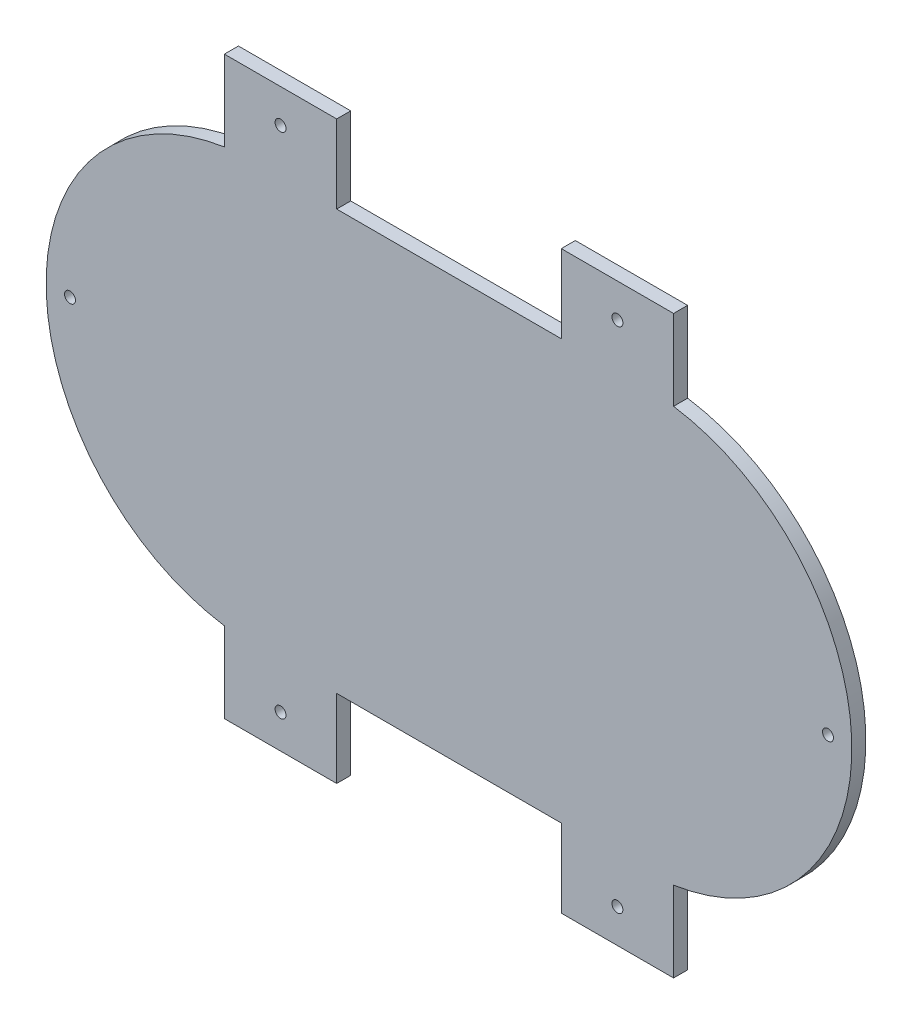
ISO-10303-21;
HEADER;
FILE_DESCRIPTION(('STEP AP214'),'2;1');
FILE_NAME('part.step','',(''),(''),'','','');
FILE_SCHEMA(('AUTOMOTIVE_DESIGN { 1 0 10303 214 1 1 1 1 }'));
ENDSEC;
DATA;
#1=APPLICATION_CONTEXT('core data for automotive mechanical design processes');
#2=APPLICATION_PROTOCOL_DEFINITION('international standard','automotive_design',2000,#1);
#3=PRODUCT_CONTEXT('',#1,'mechanical');
#4=PRODUCT('Part','Part','',(#3));
#5=PRODUCT_RELATED_PRODUCT_CATEGORY('part','',(#4));
#6=PRODUCT_DEFINITION_FORMATION('','',#4);
#7=PRODUCT_DEFINITION_CONTEXT('part definition',#1,'design');
#8=PRODUCT_DEFINITION('design','',#6,#7);
#9=PRODUCT_DEFINITION_SHAPE('','',#8);
#10=(LENGTH_UNIT() NAMED_UNIT(*) SI_UNIT(.MILLI.,.METRE.));
#11=(NAMED_UNIT(*) PLANE_ANGLE_UNIT() SI_UNIT($,.RADIAN.));
#12=(NAMED_UNIT(*) SI_UNIT($,.STERADIAN.) SOLID_ANGLE_UNIT());
#13=UNCERTAINTY_MEASURE_WITH_UNIT(LENGTH_MEASURE(1.E-05),#10,'distance_accuracy_value','');
#14=(GEOMETRIC_REPRESENTATION_CONTEXT(3) GLOBAL_UNCERTAINTY_ASSIGNED_CONTEXT((#13)) GLOBAL_UNIT_ASSIGNED_CONTEXT((#10,
#11,#12)) REPRESENTATION_CONTEXT('',''));
#15=CARTESIAN_POINT('',(0.,0.,0.));
#16=DIRECTION('',(0.,0.,1.));
#17=DIRECTION('',(1.,0.,0.));
#18=AXIS2_PLACEMENT_3D('',#15,#16,#17);
#19=CARTESIAN_POINT('',(0.,56.6121833318887,2.5));
#20=DIRECTION('',(0.,1.,0.));
#21=DIRECTION('',(0.,0.,1.));
#22=AXIS2_PLACEMENT_3D('',#19,#20,#21);
#23=PLANE('',#22);
#24=DIRECTION('',(1.,0.,0.));
#25=VECTOR('',#24,1.);
#26=CARTESIAN_POINT('',(0.,56.6121833318887,-2.5));
#27=LINE('',#26,#25);
#28=CARTESIAN_POINT('',(53.5011548474079,56.6121833318887,-2.5));
#29=VERTEX_POINT('',#28);
#30=CARTESIAN_POINT('',(133.501154847408,56.6121833318887,-2.5));
#31=VERTEX_POINT('',#30);
#32=EDGE_CURVE('E197',#29,#31,#27,.T.);
#33=ORIENTED_EDGE('',*,*,#32,.F.);
#34=DIRECTION('',(0.,0.,-1.));
#35=VECTOR('',#34,1.);
#36=CARTESIAN_POINT('',(53.5011548474079,56.6121833318887,2.5));
#37=LINE('',#36,#35);
#38=CARTESIAN_POINT('',(53.5011548474079,56.6121833318887,2.5));
#39=VERTEX_POINT('',#38);
#40=EDGE_CURVE('E11',#39,#29,#37,.T.);
#41=ORIENTED_EDGE('',*,*,#40,.F.);
#42=DIRECTION('',(1.,0.,0.));
#43=VECTOR('',#42,1.);
#44=CARTESIAN_POINT('',(0.,56.6121833318887,2.5));
#45=LINE('',#44,#43);
#46=CARTESIAN_POINT('',(133.501154847408,56.6121833318887,2.5));
#47=VERTEX_POINT('',#46);
#48=EDGE_CURVE('E251',#39,#47,#45,.T.);
#49=ORIENTED_EDGE('',*,*,#48,.T.);
#50=DIRECTION('',(0.,0.,-1.));
#51=VECTOR('',#50,1.);
#52=CARTESIAN_POINT('',(133.501154847408,56.6121833318887,2.5));
#53=LINE('',#52,#51);
#54=EDGE_CURVE('E53',#47,#31,#53,.T.);
#55=ORIENTED_EDGE('',*,*,#54,.T.);
#56=EDGE_LOOP('',(#33,#41,#49,#55));
#57=FACE_BOUND('',#56,.T.);
#58=ADVANCED_FACE('F37',(#57),#23,.T.);
#59=CARTESIAN_POINT('',(53.5011548474079,0.,2.5));
#60=DIRECTION('',(-1.,0.,0.));
#61=DIRECTION('',(0.,0.,1.));
#62=AXIS2_PLACEMENT_3D('',#59,#60,#61);
#63=PLANE('',#62);
#64=DIRECTION('',(0.,1.,0.));
#65=VECTOR('',#64,1.);
#66=CARTESIAN_POINT('',(53.5011548474079,0.,-2.5));
#67=LINE('',#66,#65);
#68=CARTESIAN_POINT('',(53.5011548474079,84.4121833318887,-2.5));
#69=VERTEX_POINT('',#68);
#70=EDGE_CURVE('E199',#29,#69,#67,.T.);
#71=ORIENTED_EDGE('',*,*,#70,.T.);
#72=DIRECTION('',(0.,0.,-1.));
#73=VECTOR('',#72,1.);
#74=CARTESIAN_POINT('',(53.5011548474079,84.4121833318887,2.5));
#75=LINE('',#74,#73);
#76=CARTESIAN_POINT('',(53.5011548474079,84.4121833318887,2.5));
#77=VERTEX_POINT('',#76);
#78=EDGE_CURVE('E45',#77,#69,#75,.T.);
#79=ORIENTED_EDGE('',*,*,#78,.F.);
#80=DIRECTION('',(0.,1.,0.));
#81=VECTOR('',#80,1.);
#82=CARTESIAN_POINT('',(53.5011548474079,0.,2.5));
#83=LINE('',#82,#81);
#84=EDGE_CURVE('E641',#39,#77,#83,.T.);
#85=ORIENTED_EDGE('',*,*,#84,.F.);
#86=ORIENTED_EDGE('',*,*,#40,.T.);
#87=EDGE_LOOP('',(#71,#79,#85,#86));
#88=FACE_BOUND('',#87,.T.);
#89=ADVANCED_FACE('F353',(#88),#63,.F.);
#90=CARTESIAN_POINT('',(0.,84.4121833318887,2.5));
#91=DIRECTION('',(0.,-1.,0.));
#92=DIRECTION('',(0.,0.,-1.));
#93=AXIS2_PLACEMENT_3D('',#90,#91,#92);
#94=PLANE('',#93);
#95=DIRECTION('',(-1.,0.,0.));
#96=VECTOR('',#95,1.);
#97=CARTESIAN_POINT('',(0.,84.4121833318887,-2.5));
#98=LINE('',#97,#96);
#99=CARTESIAN_POINT('',(13.5011548474079,84.4121833318887,-2.5));
#100=VERTEX_POINT('',#99);
#101=EDGE_CURVE('E201',#69,#100,#98,.T.);
#102=ORIENTED_EDGE('',*,*,#101,.T.);
#103=DIRECTION('',(0.,0.,-1.));
#104=VECTOR('',#103,1.);
#105=CARTESIAN_POINT('',(13.5011548474079,84.4121833318887,2.5));
#106=LINE('',#105,#104);
#107=CARTESIAN_POINT('',(13.5011548474079,84.4121833318887,2.5));
#108=VERTEX_POINT('',#107);
#109=EDGE_CURVE('E279',#108,#100,#106,.T.);
#110=ORIENTED_EDGE('',*,*,#109,.F.);
#111=DIRECTION('',(-1.,0.,0.));
#112=VECTOR('',#111,1.);
#113=CARTESIAN_POINT('',(0.,84.4121833318887,2.5));
#114=LINE('',#113,#112);
#115=EDGE_CURVE('E288',#77,#108,#114,.T.);
#116=ORIENTED_EDGE('',*,*,#115,.F.);
#117=ORIENTED_EDGE('',*,*,#78,.T.);
#118=EDGE_LOOP('',(#102,#110,#116,#117));
#119=FACE_BOUND('',#118,.T.);
#120=ADVANCED_FACE('F286',(#119),#94,.F.);
#121=CARTESIAN_POINT('',(13.5011548474079,0.,2.5));
#122=DIRECTION('',(1.,0.,0.));
#123=DIRECTION('',(0.,0.,-1.));
#124=AXIS2_PLACEMENT_3D('',#121,#122,#123);
#125=PLANE('',#124);
#126=DIRECTION('',(0.,-1.,0.));
#127=VECTOR('',#126,1.);
#128=CARTESIAN_POINT('',(13.5011548474079,0.,-2.5));
#129=LINE('',#128,#127);
#130=CARTESIAN_POINT('',(13.5011548474079,55.7677856921701,-2.5));
#131=VERTEX_POINT('',#130);
#132=EDGE_CURVE('E203',#100,#131,#129,.T.);
#133=ORIENTED_EDGE('',*,*,#132,.T.);
#134=DIRECTION('',(0.,0.,-1.));
#135=VECTOR('',#134,1.);
#136=CARTESIAN_POINT('',(13.5011548474079,55.7677856921701,2.5));
#137=LINE('',#136,#135);
#138=CARTESIAN_POINT('',(13.5011548474079,55.7677856921701,2.5));
#139=VERTEX_POINT('',#138);
#140=EDGE_CURVE('E276',#139,#131,#137,.T.);
#141=ORIENTED_EDGE('',*,*,#140,.F.);
#142=DIRECTION('',(0.,-1.,0.));
#143=VECTOR('',#142,1.);
#144=CARTESIAN_POINT('',(13.5011548474079,0.,2.5));
#145=LINE('',#144,#143);
#146=EDGE_CURVE('E308',#108,#139,#145,.T.);
#147=ORIENTED_EDGE('',*,*,#146,.F.);
#148=ORIENTED_EDGE('',*,*,#109,.T.);
#149=EDGE_LOOP('',(#133,#141,#147,#148));
#150=FACE_BOUND('',#149,.T.);
#151=ADVANCED_FACE('F299',(#150),#125,.F.);
#152=CARTESIAN_POINT('',(24.7011548474079,-18.0878166681113,2.5));
#153=DIRECTION('',(0.,0.,-1.));
#154=DIRECTION('',(-1.,0.,0.));
#155=AXIS2_PLACEMENT_3D('',#152,#153,#154);
#156=CYLINDRICAL_SURFACE('',#155,74.7);
#157=CARTESIAN_POINT('',(24.7011548474079,-18.0878166681113,-2.5));
#158=DIRECTION('',(0.,0.,1.));
#159=DIRECTION('',(1.,0.,0.));
#160=AXIS2_PLACEMENT_3D('',#157,#158,#159);
#161=CIRCLE('',#160,74.7);
#162=CARTESIAN_POINT('',(13.5011548474079,-91.9434190283927,-2.5));
#163=VERTEX_POINT('',#162);
#164=EDGE_CURVE('E205',#131,#163,#161,.T.);
#165=ORIENTED_EDGE('',*,*,#164,.T.);
#166=DIRECTION('',(0.,0.,-1.));
#167=VECTOR('',#166,1.);
#168=CARTESIAN_POINT('',(13.5011548474079,-91.9434190283927,2.5));
#169=LINE('',#168,#167);
#170=CARTESIAN_POINT('',(13.5011548474079,-91.9434190283927,2.5));
#171=VERTEX_POINT('',#170);
#172=EDGE_CURVE('E273',#171,#163,#169,.T.);
#173=ORIENTED_EDGE('',*,*,#172,.F.);
#174=CARTESIAN_POINT('',(24.7011548474079,-18.0878166681113,2.5));
#175=DIRECTION('',(0.,0.,1.));
#176=DIRECTION('',(1.,0.,0.));
#177=AXIS2_PLACEMENT_3D('',#174,#175,#176);
#178=CIRCLE('',#177,74.7);
#179=EDGE_CURVE('E305',#139,#171,#178,.T.);
#180=ORIENTED_EDGE('',*,*,#179,.F.);
#181=ORIENTED_EDGE('',*,*,#140,.T.);
#182=EDGE_LOOP('',(#165,#173,#180,#181));
#183=FACE_BOUND('',#182,.T.);
#184=ADVANCED_FACE('F303',(#183),#156,.T.);
#185=CARTESIAN_POINT('',(13.5011548474079,0.,2.5));
#186=DIRECTION('',(1.,0.,0.));
#187=DIRECTION('',(0.,0.,-1.));
#188=AXIS2_PLACEMENT_3D('',#185,#186,#187);
#189=PLANE('',#188);
#190=DIRECTION('',(0.,-1.,0.));
#191=VECTOR('',#190,1.);
#192=CARTESIAN_POINT('',(13.5011548474079,0.,-2.5));
#193=LINE('',#192,#191);
#194=CARTESIAN_POINT('',(13.5011548474079,-120.587816668111,-2.5));
#195=VERTEX_POINT('',#194);
#196=EDGE_CURVE('E207',#163,#195,#193,.T.);
#197=ORIENTED_EDGE('',*,*,#196,.T.);
#198=DIRECTION('',(0.,0.,-1.));
#199=VECTOR('',#198,1.);
#200=CARTESIAN_POINT('',(13.5011548474079,-120.587816668111,2.5));
#201=LINE('',#200,#199);
#202=CARTESIAN_POINT('',(13.5011548474079,-120.587816668111,2.5));
#203=VERTEX_POINT('',#202);
#204=EDGE_CURVE('E271',#203,#195,#201,.T.);
#205=ORIENTED_EDGE('',*,*,#204,.F.);
#206=DIRECTION('',(0.,-1.,0.));
#207=VECTOR('',#206,1.);
#208=CARTESIAN_POINT('',(13.5011548474079,0.,2.5));
#209=LINE('',#208,#207);
#210=EDGE_CURVE('E307',#171,#203,#209,.T.);
#211=ORIENTED_EDGE('',*,*,#210,.F.);
#212=ORIENTED_EDGE('',*,*,#172,.T.);
#213=EDGE_LOOP('',(#197,#205,#211,#212));
#214=FACE_BOUND('',#213,.T.);
#215=ADVANCED_FACE('F366',(#214),#189,.F.);
#216=CARTESIAN_POINT('',(0.,-120.587816668111,2.5));
#217=DIRECTION('',(0.,-1.,0.));
#218=DIRECTION('',(0.,0.,-1.));
#219=AXIS2_PLACEMENT_3D('',#216,#217,#218);
#220=PLANE('',#219);
#221=DIRECTION('',(-1.,0.,0.));
#222=VECTOR('',#221,1.);
#223=CARTESIAN_POINT('',(0.,-120.587816668111,-2.5));
#224=LINE('',#223,#222);
#225=CARTESIAN_POINT('',(53.5011548474079,-120.587816668111,-2.5));
#226=VERTEX_POINT('',#225);
#227=EDGE_CURVE('E210',#226,#195,#224,.T.);
#228=ORIENTED_EDGE('',*,*,#227,.F.);
#229=DIRECTION('',(0.,0.,-1.));
#230=VECTOR('',#229,1.);
#231=CARTESIAN_POINT('',(53.5011548474079,-120.587816668111,2.5));
#232=LINE('',#231,#230);
#233=CARTESIAN_POINT('',(53.5011548474079,-120.587816668111,2.5));
#234=VERTEX_POINT('',#233);
#235=EDGE_CURVE('E269',#234,#226,#232,.T.);
#236=ORIENTED_EDGE('',*,*,#235,.F.);
#237=DIRECTION('',(-1.,0.,0.));
#238=VECTOR('',#237,1.);
#239=CARTESIAN_POINT('',(0.,-120.587816668111,2.5));
#240=LINE('',#239,#238);
#241=EDGE_CURVE('E310',#234,#203,#240,.T.);
#242=ORIENTED_EDGE('',*,*,#241,.T.);
#243=ORIENTED_EDGE('',*,*,#204,.T.);
#244=EDGE_LOOP('',(#228,#236,#242,#243));
#245=FACE_BOUND('',#244,.T.);
#246=ADVANCED_FACE('F369',(#245),#220,.T.);
#247=CARTESIAN_POINT('',(53.5011548474079,0.,2.5));
#248=DIRECTION('',(1.,0.,0.));
#249=DIRECTION('',(0.,1.,0.));
#250=AXIS2_PLACEMENT_3D('',#247,#248,#249);
#251=PLANE('',#250);
#252=DIRECTION('',(0.,-1.,0.));
#253=VECTOR('',#252,1.);
#254=CARTESIAN_POINT('',(53.5011548474079,0.,-2.5));
#255=LINE('',#254,#253);
#256=CARTESIAN_POINT('',(53.5011548474079,-92.7878166681113,-2.5));
#257=VERTEX_POINT('',#256);
#258=EDGE_CURVE('E213',#257,#226,#255,.T.);
#259=ORIENTED_EDGE('',*,*,#258,.F.);
#260=DIRECTION('',(0.,0.,-1.));
#261=VECTOR('',#260,1.);
#262=CARTESIAN_POINT('',(53.5011548474079,-92.7878166681113,2.5));
#263=LINE('',#262,#261);
#264=CARTESIAN_POINT('',(53.5011548474079,-92.7878166681113,2.5));
#265=VERTEX_POINT('',#264);
#266=EDGE_CURVE('E267',#265,#257,#263,.T.);
#267=ORIENTED_EDGE('',*,*,#266,.F.);
#268=DIRECTION('',(0.,-1.,0.));
#269=VECTOR('',#268,1.);
#270=CARTESIAN_POINT('',(53.5011548474079,0.,2.5));
#271=LINE('',#270,#269);
#272=EDGE_CURVE('E317',#265,#234,#271,.T.);
#273=ORIENTED_EDGE('',*,*,#272,.T.);
#274=ORIENTED_EDGE('',*,*,#235,.T.);
#275=EDGE_LOOP('',(#259,#267,#273,#274));
#276=FACE_BOUND('',#275,.T.);
#277=ADVANCED_FACE('F373',(#276),#251,.T.);
#278=CARTESIAN_POINT('',(0.,-92.7878166681113,2.5));
#279=DIRECTION('',(0.,1.,0.));
#280=DIRECTION('',(0.,0.,1.));
#281=AXIS2_PLACEMENT_3D('',#278,#279,#280);
#282=PLANE('',#281);
#283=DIRECTION('',(1.,0.,0.));
#284=VECTOR('',#283,1.);
#285=CARTESIAN_POINT('',(0.,-92.7878166681113,-2.5));
#286=LINE('',#285,#284);
#287=CARTESIAN_POINT('',(133.501154847408,-92.7878166681113,-2.5));
#288=VERTEX_POINT('',#287);
#289=EDGE_CURVE('E216',#257,#288,#286,.T.);
#290=ORIENTED_EDGE('',*,*,#289,.T.);
#291=DIRECTION('',(0.,0.,-1.));
#292=VECTOR('',#291,1.);
#293=CARTESIAN_POINT('',(133.501154847408,-92.7878166681113,2.5));
#294=LINE('',#293,#292);
#295=CARTESIAN_POINT('',(133.501154847408,-92.7878166681113,2.5));
#296=VERTEX_POINT('',#295);
#297=EDGE_CURVE('E264',#296,#288,#294,.T.);
#298=ORIENTED_EDGE('',*,*,#297,.F.);
#299=DIRECTION('',(1.,0.,0.));
#300=VECTOR('',#299,1.);
#301=CARTESIAN_POINT('',(0.,-92.7878166681113,2.5));
#302=LINE('',#301,#300);
#303=EDGE_CURVE('E320',#265,#296,#302,.T.);
#304=ORIENTED_EDGE('',*,*,#303,.F.);
#305=ORIENTED_EDGE('',*,*,#266,.T.);
#306=EDGE_LOOP('',(#290,#298,#304,#305));
#307=FACE_BOUND('',#306,.T.);
#308=ADVANCED_FACE('F377',(#307),#282,.F.);
#309=CARTESIAN_POINT('',(133.501154847408,0.,2.5));
#310=DIRECTION('',(1.,0.,0.));
#311=DIRECTION('',(0.,0.,-1.));
#312=AXIS2_PLACEMENT_3D('',#309,#310,#311);
#313=PLANE('',#312);
#314=DIRECTION('',(0.,-1.,0.));
#315=VECTOR('',#314,1.);
#316=CARTESIAN_POINT('',(133.501154847408,0.,-2.5));
#317=LINE('',#316,#315);
#318=CARTESIAN_POINT('',(133.501154847408,-120.587816668111,-2.5));
#319=VERTEX_POINT('',#318);
#320=EDGE_CURVE('E218',#288,#319,#317,.T.);
#321=ORIENTED_EDGE('',*,*,#320,.T.);
#322=DIRECTION('',(0.,0.,-1.));
#323=VECTOR('',#322,1.);
#324=CARTESIAN_POINT('',(133.501154847408,-120.587816668111,2.5));
#325=LINE('',#324,#323);
#326=CARTESIAN_POINT('',(133.501154847408,-120.587816668111,2.5));
#327=VERTEX_POINT('',#326);
#328=EDGE_CURVE('E261',#327,#319,#325,.T.);
#329=ORIENTED_EDGE('',*,*,#328,.F.);
#330=DIRECTION('',(0.,-1.,0.));
#331=VECTOR('',#330,1.);
#332=CARTESIAN_POINT('',(133.501154847408,0.,2.5));
#333=LINE('',#332,#331);
#334=EDGE_CURVE('E322',#296,#327,#333,.T.);
#335=ORIENTED_EDGE('',*,*,#334,.F.);
#336=ORIENTED_EDGE('',*,*,#297,.T.);
#337=EDGE_LOOP('',(#321,#329,#335,#336));
#338=FACE_BOUND('',#337,.T.);
#339=ADVANCED_FACE('F381',(#338),#313,.F.);
#340=CARTESIAN_POINT('',(0.,-120.587816668111,2.5));
#341=DIRECTION('',(0.,1.,0.));
#342=DIRECTION('',(0.,0.,1.));
#343=AXIS2_PLACEMENT_3D('',#340,#341,#342);
#344=PLANE('',#343);
#345=DIRECTION('',(1.,0.,0.));
#346=VECTOR('',#345,1.);
#347=CARTESIAN_POINT('',(0.,-120.587816668111,-2.5));
#348=LINE('',#347,#346);
#349=CARTESIAN_POINT('',(173.501154847408,-120.587816668111,-2.5));
#350=VERTEX_POINT('',#349);
#351=EDGE_CURVE('E220',#319,#350,#348,.T.);
#352=ORIENTED_EDGE('',*,*,#351,.T.);
#353=DIRECTION('',(0.,0.,-1.));
#354=VECTOR('',#353,1.);
#355=CARTESIAN_POINT('',(173.501154847408,-120.587816668111,2.5));
#356=LINE('',#355,#354);
#357=CARTESIAN_POINT('',(173.501154847408,-120.587816668111,2.5));
#358=VERTEX_POINT('',#357);
#359=EDGE_CURVE('E258',#358,#350,#356,.T.);
#360=ORIENTED_EDGE('',*,*,#359,.F.);
#361=DIRECTION('',(1.,0.,0.));
#362=VECTOR('',#361,1.);
#363=CARTESIAN_POINT('',(0.,-120.587816668111,2.5));
#364=LINE('',#363,#362);
#365=EDGE_CURVE('E324',#327,#358,#364,.T.);
#366=ORIENTED_EDGE('',*,*,#365,.F.);
#367=ORIENTED_EDGE('',*,*,#328,.T.);
#368=EDGE_LOOP('',(#352,#360,#366,#367));
#369=FACE_BOUND('',#368,.T.);
#370=ADVANCED_FACE('F385',(#369),#344,.F.);
#371=CARTESIAN_POINT('',(173.501154847408,0.,2.5));
#372=DIRECTION('',(-1.,0.,0.));
#373=DIRECTION('',(0.,0.,1.));
#374=AXIS2_PLACEMENT_3D('',#371,#372,#373);
#375=PLANE('',#374);
#376=DIRECTION('',(0.,1.,0.));
#377=VECTOR('',#376,1.);
#378=CARTESIAN_POINT('',(173.501154847408,0.,-2.5));
#379=LINE('',#378,#377);
#380=CARTESIAN_POINT('',(173.501154847408,-91.9434190283927,-2.5));
#381=VERTEX_POINT('',#380);
#382=EDGE_CURVE('E222',#350,#381,#379,.T.);
#383=ORIENTED_EDGE('',*,*,#382,.T.);
#384=DIRECTION('',(0.,0.,-1.));
#385=VECTOR('',#384,1.);
#386=CARTESIAN_POINT('',(173.501154847408,-91.9434190283927,2.5));
#387=LINE('',#386,#385);
#388=CARTESIAN_POINT('',(173.501154847408,-91.9434190283927,2.5));
#389=VERTEX_POINT('',#388);
#390=EDGE_CURVE('E255',#389,#381,#387,.T.);
#391=ORIENTED_EDGE('',*,*,#390,.F.);
#392=DIRECTION('',(0.,1.,0.));
#393=VECTOR('',#392,1.);
#394=CARTESIAN_POINT('',(173.501154847408,0.,2.5));
#395=LINE('',#394,#393);
#396=EDGE_CURVE('E326',#358,#389,#395,.T.);
#397=ORIENTED_EDGE('',*,*,#396,.F.);
#398=ORIENTED_EDGE('',*,*,#359,.T.);
#399=EDGE_LOOP('',(#383,#391,#397,#398));
#400=FACE_BOUND('',#399,.T.);
#401=ADVANCED_FACE('F332',(#400),#375,.F.);
#402=CARTESIAN_POINT('',(162.301154847408,-18.0878166681113,2.5));
#403=DIRECTION('',(0.,0.,-1.));
#404=DIRECTION('',(-1.,0.,0.));
#405=AXIS2_PLACEMENT_3D('',#402,#403,#404);
#406=CYLINDRICAL_SURFACE('',#405,74.7);
#407=CARTESIAN_POINT('',(162.301154847408,-18.0878166681113,-2.5));
#408=DIRECTION('',(0.,0.,1.));
#409=DIRECTION('',(1.,0.,0.));
#410=AXIS2_PLACEMENT_3D('',#407,#408,#409);
#411=CIRCLE('',#410,74.7);
#412=CARTESIAN_POINT('',(173.501154847408,55.7677856921701,-2.5));
#413=VERTEX_POINT('',#412);
#414=EDGE_CURVE('E224',#381,#413,#411,.T.);
#415=ORIENTED_EDGE('',*,*,#414,.T.);
#416=DIRECTION('',(0.,0.,-1.));
#417=VECTOR('',#416,1.);
#418=CARTESIAN_POINT('',(173.501154847408,55.7677856921701,2.5));
#419=LINE('',#418,#417);
#420=CARTESIAN_POINT('',(173.501154847408,55.7677856921701,2.5));
#421=VERTEX_POINT('',#420);
#422=EDGE_CURVE('E160',#421,#413,#419,.T.);
#423=ORIENTED_EDGE('',*,*,#422,.F.);
#424=CARTESIAN_POINT('',(162.301154847408,-18.0878166681113,2.5));
#425=DIRECTION('',(0.,0.,1.));
#426=DIRECTION('',(1.,0.,0.));
#427=AXIS2_PLACEMENT_3D('',#424,#425,#426);
#428=CIRCLE('',#427,74.7);
#429=EDGE_CURVE('E170',#389,#421,#428,.T.);
#430=ORIENTED_EDGE('',*,*,#429,.F.);
#431=ORIENTED_EDGE('',*,*,#390,.T.);
#432=EDGE_LOOP('',(#415,#423,#430,#431));
#433=FACE_BOUND('',#432,.T.);
#434=ADVANCED_FACE('F336',(#433),#406,.T.);
#435=CARTESIAN_POINT('',(173.501154847408,0.,2.5));
#436=DIRECTION('',(1.,0.,0.));
#437=DIRECTION('',(0.,0.,-1.));
#438=AXIS2_PLACEMENT_3D('',#435,#436,#437);
#439=PLANE('',#438);
#440=DIRECTION('',(0.,-1.,0.));
#441=VECTOR('',#440,1.);
#442=CARTESIAN_POINT('',(173.501154847408,0.,-2.5));
#443=LINE('',#442,#441);
#444=CARTESIAN_POINT('',(173.501154847408,84.4121833318887,-2.5));
#445=VERTEX_POINT('',#444);
#446=EDGE_CURVE('E156',#445,#413,#443,.T.);
#447=ORIENTED_EDGE('',*,*,#446,.F.);
#448=DIRECTION('',(0.,0.,-1.));
#449=VECTOR('',#448,1.);
#450=CARTESIAN_POINT('',(173.501154847408,84.4121833318887,2.5));
#451=LINE('',#450,#449);
#452=CARTESIAN_POINT('',(173.501154847408,84.4121833318887,2.5));
#453=VERTEX_POINT('',#452);
#454=EDGE_CURVE('E151',#453,#445,#451,.T.);
#455=ORIENTED_EDGE('',*,*,#454,.F.);
#456=DIRECTION('',(0.,-1.,0.));
#457=VECTOR('',#456,1.);
#458=CARTESIAN_POINT('',(173.501154847408,0.,2.5));
#459=LINE('',#458,#457);
#460=EDGE_CURVE('E154',#453,#421,#459,.T.);
#461=ORIENTED_EDGE('',*,*,#460,.T.);
#462=ORIENTED_EDGE('',*,*,#422,.T.);
#463=EDGE_LOOP('',(#447,#455,#461,#462));
#464=FACE_BOUND('',#463,.T.);
#465=ADVANCED_FACE('F153',(#464),#439,.T.);
#466=CARTESIAN_POINT('',(0.,84.4121833318887,2.5));
#467=DIRECTION('',(0.,1.,0.));
#468=DIRECTION('',(0.,0.,1.));
#469=AXIS2_PLACEMENT_3D('',#466,#467,#468);
#470=PLANE('',#469);
#471=DIRECTION('',(1.,0.,0.));
#472=VECTOR('',#471,1.);
#473=CARTESIAN_POINT('',(0.,84.4121833318887,-2.5));
#474=LINE('',#473,#472);
#475=CARTESIAN_POINT('',(133.501154847408,84.4121833318887,-2.5));
#476=VERTEX_POINT('',#475);
#477=EDGE_CURVE('E228',#476,#445,#474,.T.);
#478=ORIENTED_EDGE('',*,*,#477,.F.);
#479=DIRECTION('',(0.,0.,-1.));
#480=VECTOR('',#479,1.);
#481=CARTESIAN_POINT('',(133.501154847408,84.4121833318887,2.5));
#482=LINE('',#481,#480);
#483=CARTESIAN_POINT('',(133.501154847408,84.4121833318887,2.5));
#484=VERTEX_POINT('',#483);
#485=EDGE_CURVE('E102',#484,#476,#482,.T.);
#486=ORIENTED_EDGE('',*,*,#485,.F.);
#487=DIRECTION('',(1.,0.,0.));
#488=VECTOR('',#487,1.);
#489=CARTESIAN_POINT('',(0.,84.4121833318887,2.5));
#490=LINE('',#489,#488);
#491=EDGE_CURVE('E168',#484,#453,#490,.T.);
#492=ORIENTED_EDGE('',*,*,#491,.T.);
#493=ORIENTED_EDGE('',*,*,#454,.T.);
#494=EDGE_LOOP('',(#478,#486,#492,#493));
#495=FACE_BOUND('',#494,.T.);
#496=ADVANCED_FACE('F173',(#495),#470,.T.);
#497=CARTESIAN_POINT('',(153.501154847408,72.4121833318887,2.5));
#498=DIRECTION('',(0.,0.,-1.));
#499=DIRECTION('',(-1.,0.,0.));
#500=AXIS2_PLACEMENT_3D('',#497,#498,#499);
#501=CYLINDRICAL_SURFACE('',#500,1.95000000000003);
#502=CARTESIAN_POINT('',(153.501154847408,72.4121833318887,2.5));
#503=DIRECTION('',(0.,0.,1.));
#504=DIRECTION('',(1.,0.,0.));
#505=AXIS2_PLACEMENT_3D('',#502,#503,#504);
#506=CIRCLE('',#505,1.95000000000003);
#507=CARTESIAN_POINT('',(155.451154847408,72.4121833318887,2.5));
#508=VERTEX_POINT('',#507);
#509=EDGE_CURVE('E191',#508,#508,#506,.T.);
#510=ORIENTED_EDGE('',*,*,#509,.T.);
#511=EDGE_LOOP('',(#510));
#512=FACE_BOUND('',#511,.T.);
#513=CARTESIAN_POINT('',(153.501154847408,72.4121833318887,-2.5));
#514=DIRECTION('',(0.,0.,1.));
#515=DIRECTION('',(1.,0.,0.));
#516=AXIS2_PLACEMENT_3D('',#513,#514,#515);
#517=CIRCLE('',#516,1.95000000000003);
#518=CARTESIAN_POINT('',(155.451154847408,72.4121833318887,-2.5));
#519=VERTEX_POINT('',#518);
#520=EDGE_CURVE('E245',#519,#519,#517,.T.);
#521=ORIENTED_EDGE('',*,*,#520,.F.);
#522=EDGE_LOOP('',(#521));
#523=FACE_BOUND('',#522,.T.);
#524=ADVANCED_FACE('F396',(#512,#523),#501,.F.);
#525=CARTESIAN_POINT('',(33.5011548474079,72.4121833318887,2.5));
#526=DIRECTION('',(0.,0.,-1.));
#527=DIRECTION('',(-1.,0.,0.));
#528=AXIS2_PLACEMENT_3D('',#525,#526,#527);
#529=CYLINDRICAL_SURFACE('',#528,1.95);
#530=CARTESIAN_POINT('',(33.5011548474079,72.4121833318887,2.5));
#531=DIRECTION('',(0.,0.,1.));
#532=DIRECTION('',(1.,0.,0.));
#533=AXIS2_PLACEMENT_3D('',#530,#531,#532);
#534=CIRCLE('',#533,1.95);
#535=CARTESIAN_POINT('',(35.4511548474079,72.4121833318887,2.5));
#536=VERTEX_POINT('',#535);
#537=EDGE_CURVE('E188',#536,#536,#534,.T.);
#538=ORIENTED_EDGE('',*,*,#537,.T.);
#539=EDGE_LOOP('',(#538));
#540=FACE_BOUND('',#539,.T.);
#541=CARTESIAN_POINT('',(33.5011548474079,72.4121833318887,-2.5));
#542=DIRECTION('',(0.,0.,1.));
#543=DIRECTION('',(1.,0.,0.));
#544=AXIS2_PLACEMENT_3D('',#541,#542,#543);
#545=CIRCLE('',#544,1.95);
#546=CARTESIAN_POINT('',(35.4511548474079,72.4121833318887,-2.5));
#547=VERTEX_POINT('',#546);
#548=EDGE_CURVE('E242',#547,#547,#545,.T.);
#549=ORIENTED_EDGE('',*,*,#548,.F.);
#550=EDGE_LOOP('',(#549));
#551=FACE_BOUND('',#550,.T.);
#552=ADVANCED_FACE('F400',(#540,#551),#529,.F.);
#553=CARTESIAN_POINT('',(228.501154847408,-18.0878166681113,2.5));
#554=DIRECTION('',(0.,0.,-1.));
#555=DIRECTION('',(-1.,0.,0.));
#556=AXIS2_PLACEMENT_3D('',#553,#554,#555);
#557=CYLINDRICAL_SURFACE('',#556,1.95);
#558=CARTESIAN_POINT('',(228.501154847408,-18.0878166681113,2.5));
#559=DIRECTION('',(0.,0.,1.));
#560=DIRECTION('',(1.,0.,0.));
#561=AXIS2_PLACEMENT_3D('',#558,#559,#560);
#562=CIRCLE('',#561,1.95);
#563=CARTESIAN_POINT('',(230.451154847408,-18.0878166681113,2.5));
#564=VERTEX_POINT('',#563);
#565=EDGE_CURVE('E185',#564,#564,#562,.T.);
#566=ORIENTED_EDGE('',*,*,#565,.T.);
#567=EDGE_LOOP('',(#566));
#568=FACE_BOUND('',#567,.T.);
#569=CARTESIAN_POINT('',(228.501154847408,-18.0878166681113,-2.5));
#570=DIRECTION('',(0.,0.,1.));
#571=DIRECTION('',(1.,0.,0.));
#572=AXIS2_PLACEMENT_3D('',#569,#570,#571);
#573=CIRCLE('',#572,1.95);
#574=CARTESIAN_POINT('',(230.451154847408,-18.0878166681113,-2.5));
#575=VERTEX_POINT('',#574);
#576=EDGE_CURVE('E239',#575,#575,#573,.T.);
#577=ORIENTED_EDGE('',*,*,#576,.F.);
#578=EDGE_LOOP('',(#577));
#579=FACE_BOUND('',#578,.T.);
#580=ADVANCED_FACE('F406',(#568,#579),#557,.F.);
#581=CARTESIAN_POINT('',(-41.4988451525921,-18.0878166681113,2.5));
#582=DIRECTION('',(0.,0.,-1.));
#583=DIRECTION('',(-1.,0.,0.));
#584=AXIS2_PLACEMENT_3D('',#581,#582,#583);
#585=CYLINDRICAL_SURFACE('',#584,1.95);
#586=CARTESIAN_POINT('',(-41.4988451525921,-18.0878166681113,2.5));
#587=DIRECTION('',(0.,0.,1.));
#588=DIRECTION('',(1.,0.,0.));
#589=AXIS2_PLACEMENT_3D('',#586,#587,#588);
#590=CIRCLE('',#589,1.95);
#591=CARTESIAN_POINT('',(-39.5488451525921,-18.0878166681113,2.5));
#592=VERTEX_POINT('',#591);
#593=EDGE_CURVE('E182',#592,#592,#590,.T.);
#594=ORIENTED_EDGE('',*,*,#593,.T.);
#595=EDGE_LOOP('',(#594));
#596=FACE_BOUND('',#595,.T.);
#597=CARTESIAN_POINT('',(-41.4988451525921,-18.0878166681113,-2.5));
#598=DIRECTION('',(0.,0.,1.));
#599=DIRECTION('',(1.,0.,0.));
#600=AXIS2_PLACEMENT_3D('',#597,#598,#599);
#601=CIRCLE('',#600,1.95);
#602=CARTESIAN_POINT('',(-39.5488451525921,-18.0878166681113,-2.5));
#603=VERTEX_POINT('',#602);
#604=EDGE_CURVE('E236',#603,#603,#601,.T.);
#605=ORIENTED_EDGE('',*,*,#604,.F.);
#606=EDGE_LOOP('',(#605));
#607=FACE_BOUND('',#606,.T.);
#608=ADVANCED_FACE('F348',(#596,#607),#585,.F.);
#609=CARTESIAN_POINT('',(153.501154847408,-108.587816668111,2.5));
#610=DIRECTION('',(0.,0.,-1.));
#611=DIRECTION('',(-1.,0.,0.));
#612=AXIS2_PLACEMENT_3D('',#609,#610,#611);
#613=CYLINDRICAL_SURFACE('',#612,1.95000000000003);
#614=CARTESIAN_POINT('',(153.501154847408,-108.587816668111,2.5));
#615=DIRECTION('',(0.,0.,1.));
#616=DIRECTION('',(1.,0.,0.));
#617=AXIS2_PLACEMENT_3D('',#614,#615,#616);
#618=CIRCLE('',#617,1.95000000000003);
#619=CARTESIAN_POINT('',(155.451154847408,-108.587816668111,2.5));
#620=VERTEX_POINT('',#619);
#621=EDGE_CURVE('E176',#620,#620,#618,.T.);
#622=ORIENTED_EDGE('',*,*,#621,.T.);
#623=EDGE_LOOP('',(#622));
#624=FACE_BOUND('',#623,.T.);
#625=CARTESIAN_POINT('',(153.501154847408,-108.587816668111,-2.5));
#626=DIRECTION('',(0.,0.,1.));
#627=DIRECTION('',(1.,0.,0.));
#628=AXIS2_PLACEMENT_3D('',#625,#626,#627);
#629=CIRCLE('',#628,1.95000000000003);
#630=CARTESIAN_POINT('',(155.451154847408,-108.587816668111,-2.5));
#631=VERTEX_POINT('',#630);
#632=EDGE_CURVE('E233',#631,#631,#629,.T.);
#633=ORIENTED_EDGE('',*,*,#632,.F.);
#634=EDGE_LOOP('',(#633));
#635=FACE_BOUND('',#634,.T.);
#636=ADVANCED_FACE('F340',(#624,#635),#613,.F.);
#637=CARTESIAN_POINT('',(133.501154847408,0.,2.5));
#638=DIRECTION('',(-1.,0.,0.));
#639=DIRECTION('',(0.,0.,1.));
#640=AXIS2_PLACEMENT_3D('',#637,#638,#639);
#641=PLANE('',#640);
#642=DIRECTION('',(0.,1.,0.));
#643=VECTOR('',#642,1.);
#644=CARTESIAN_POINT('',(133.501154847408,0.,-2.5));
#645=LINE('',#644,#643);
#646=EDGE_CURVE('E230',#31,#476,#645,.T.);
#647=ORIENTED_EDGE('',*,*,#646,.F.);
#648=ORIENTED_EDGE('',*,*,#54,.F.);
#649=DIRECTION('',(0.,1.,0.));
#650=VECTOR('',#649,1.);
#651=CARTESIAN_POINT('',(133.501154847408,0.,2.5));
#652=LINE('',#651,#650);
#653=EDGE_CURVE('E174',#47,#484,#652,.T.);
#654=ORIENTED_EDGE('',*,*,#653,.T.);
#655=ORIENTED_EDGE('',*,*,#485,.T.);
#656=EDGE_LOOP('',(#647,#648,#654,#655));
#657=FACE_BOUND('',#656,.T.);
#658=ADVANCED_FACE('F337',(#657),#641,.T.);
#659=CARTESIAN_POINT('',(33.5011548474079,-108.587816668111,2.5));
#660=DIRECTION('',(0.,0.,-1.));
#661=DIRECTION('',(-1.,0.,0.));
#662=AXIS2_PLACEMENT_3D('',#659,#660,#661);
#663=CYLINDRICAL_SURFACE('',#662,1.95);
#664=CARTESIAN_POINT('',(33.5011548474079,-108.587816668111,2.5));
#665=DIRECTION('',(0.,0.,1.));
#666=DIRECTION('',(1.,0.,0.));
#667=AXIS2_PLACEMENT_3D('',#664,#665,#666);
#668=CIRCLE('',#667,1.95);
#669=CARTESIAN_POINT('',(35.4511548474079,-108.587816668111,2.5));
#670=VERTEX_POINT('',#669);
#671=EDGE_CURVE('E194',#670,#670,#668,.T.);
#672=ORIENTED_EDGE('',*,*,#671,.T.);
#673=EDGE_LOOP('',(#672));
#674=FACE_BOUND('',#673,.T.);
#675=CARTESIAN_POINT('',(33.5011548474079,-108.587816668111,-2.5));
#676=DIRECTION('',(0.,0.,1.));
#677=DIRECTION('',(1.,0.,0.));
#678=AXIS2_PLACEMENT_3D('',#675,#676,#677);
#679=CIRCLE('',#678,1.95);
#680=CARTESIAN_POINT('',(35.4511548474079,-108.587816668111,-2.5));
#681=VERTEX_POINT('',#680);
#682=EDGE_CURVE('E248',#681,#681,#679,.T.);
#683=ORIENTED_EDGE('',*,*,#682,.F.);
#684=EDGE_LOOP('',(#683));
#685=FACE_BOUND('',#684,.T.);
#686=ADVANCED_FACE('F339',(#674,#685),#663,.F.);
#687=CARTESIAN_POINT('',(0.,0.,2.5));
#688=DIRECTION('',(0.,0.,1.));
#689=DIRECTION('',(1.,0.,0.));
#690=AXIS2_PLACEMENT_3D('',#687,#688,#689);
#691=PLANE('',#690);
#692=ORIENTED_EDGE('',*,*,#48,.F.);
#693=ORIENTED_EDGE('',*,*,#84,.T.);
#694=ORIENTED_EDGE('',*,*,#115,.T.);
#695=ORIENTED_EDGE('',*,*,#146,.T.);
#696=ORIENTED_EDGE('',*,*,#179,.T.);
#697=ORIENTED_EDGE('',*,*,#210,.T.);
#698=ORIENTED_EDGE('',*,*,#241,.F.);
#699=ORIENTED_EDGE('',*,*,#272,.F.);
#700=ORIENTED_EDGE('',*,*,#303,.T.);
#701=ORIENTED_EDGE('',*,*,#334,.T.);
#702=ORIENTED_EDGE('',*,*,#365,.T.);
#703=ORIENTED_EDGE('',*,*,#396,.T.);
#704=ORIENTED_EDGE('',*,*,#429,.T.);
#705=ORIENTED_EDGE('',*,*,#460,.F.);
#706=ORIENTED_EDGE('',*,*,#491,.F.);
#707=ORIENTED_EDGE('',*,*,#653,.F.);
#708=EDGE_LOOP('',(#692,#693,#694,#695,#696,#697,#698,#699,#700,#701,#702,#703,#704,#705,#706,#707));
#709=FACE_BOUND('',#708,.T.);
#710=ORIENTED_EDGE('',*,*,#621,.F.);
#711=EDGE_LOOP('',(#710));
#712=FACE_BOUND('',#711,.T.);
#713=ORIENTED_EDGE('',*,*,#593,.F.);
#714=EDGE_LOOP('',(#713));
#715=FACE_BOUND('',#714,.T.);
#716=ORIENTED_EDGE('',*,*,#565,.F.);
#717=EDGE_LOOP('',(#716));
#718=FACE_BOUND('',#717,.T.);
#719=ORIENTED_EDGE('',*,*,#537,.F.);
#720=EDGE_LOOP('',(#719));
#721=FACE_BOUND('',#720,.T.);
#722=ORIENTED_EDGE('',*,*,#509,.F.);
#723=EDGE_LOOP('',(#722));
#724=FACE_BOUND('',#723,.T.);
#725=ORIENTED_EDGE('',*,*,#671,.F.);
#726=EDGE_LOOP('',(#725));
#727=FACE_BOUND('',#726,.T.);
#728=ADVANCED_FACE('F165',(#709,#712,#715,#718,#721,#724,#727),#691,.T.);
#729=CARTESIAN_POINT('',(0.,0.,-2.5));
#730=DIRECTION('',(0.,0.,1.));
#731=DIRECTION('',(1.,0.,0.));
#732=AXIS2_PLACEMENT_3D('',#729,#730,#731);
#733=PLANE('',#732);
#734=ORIENTED_EDGE('',*,*,#32,.T.);
#735=ORIENTED_EDGE('',*,*,#646,.T.);
#736=ORIENTED_EDGE('',*,*,#477,.T.);
#737=ORIENTED_EDGE('',*,*,#446,.T.);
#738=ORIENTED_EDGE('',*,*,#414,.F.);
#739=ORIENTED_EDGE('',*,*,#382,.F.);
#740=ORIENTED_EDGE('',*,*,#351,.F.);
#741=ORIENTED_EDGE('',*,*,#320,.F.);
#742=ORIENTED_EDGE('',*,*,#289,.F.);
#743=ORIENTED_EDGE('',*,*,#258,.T.);
#744=ORIENTED_EDGE('',*,*,#227,.T.);
#745=ORIENTED_EDGE('',*,*,#196,.F.);
#746=ORIENTED_EDGE('',*,*,#164,.F.);
#747=ORIENTED_EDGE('',*,*,#132,.F.);
#748=ORIENTED_EDGE('',*,*,#101,.F.);
#749=ORIENTED_EDGE('',*,*,#70,.F.);
#750=EDGE_LOOP('',(#734,#735,#736,#737,#738,#739,#740,#741,#742,#743,#744,#745,#746,#747,#748,#749));
#751=FACE_BOUND('',#750,.T.);
#752=ORIENTED_EDGE('',*,*,#632,.T.);
#753=EDGE_LOOP('',(#752));
#754=FACE_BOUND('',#753,.T.);
#755=ORIENTED_EDGE('',*,*,#604,.T.);
#756=EDGE_LOOP('',(#755));
#757=FACE_BOUND('',#756,.T.);
#758=ORIENTED_EDGE('',*,*,#576,.T.);
#759=EDGE_LOOP('',(#758));
#760=FACE_BOUND('',#759,.T.);
#761=ORIENTED_EDGE('',*,*,#548,.T.);
#762=EDGE_LOOP('',(#761));
#763=FACE_BOUND('',#762,.T.);
#764=ORIENTED_EDGE('',*,*,#520,.T.);
#765=EDGE_LOOP('',(#764));
#766=FACE_BOUND('',#765,.T.);
#767=ORIENTED_EDGE('',*,*,#682,.T.);
#768=EDGE_LOOP('',(#767));
#769=FACE_BOUND('',#768,.T.);
#770=ADVANCED_FACE('F293',(#751,#754,#757,#760,#763,#766,#769),#733,.F.);
#771=CLOSED_SHELL('',(#58,#89,#120,#151,#184,#215,#246,#277,#308,#339,#370,#401,#434,#465,#496,
#524,#552,#580,#608,#636,#658,#686,#728,#770));
#772=MANIFOLD_SOLID_BREP('B2',#771);
#773=ADVANCED_BREP_SHAPE_REPRESENTATION('',(#18,#772),#14);
#774=SHAPE_DEFINITION_REPRESENTATION(#9,#773);
ENDSEC;
END-ISO-10303-21;
